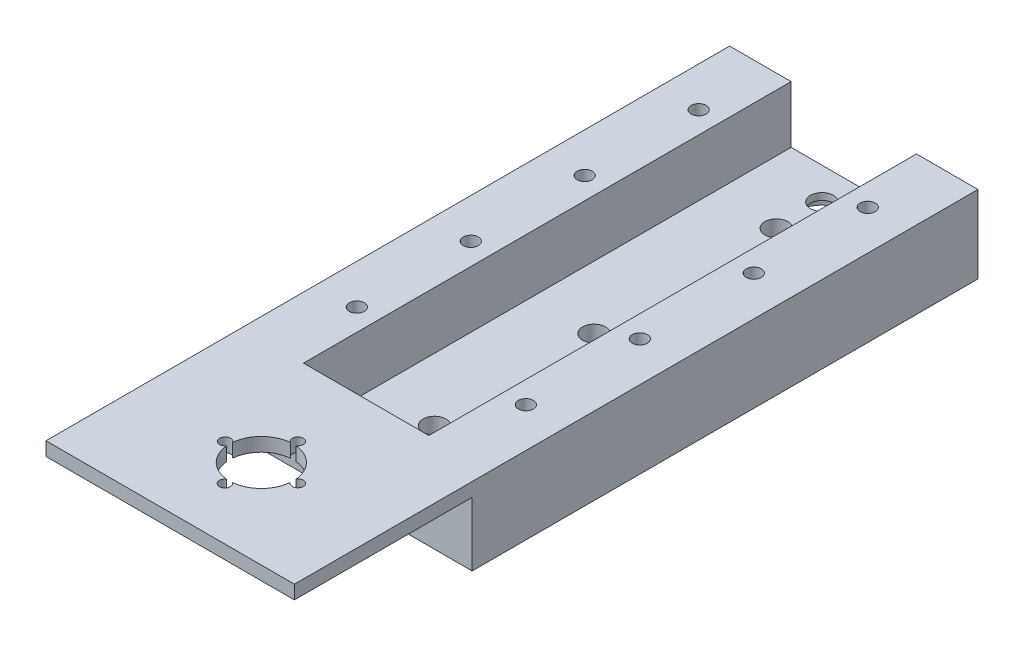
ISO-10303-21;
HEADER;
FILE_DESCRIPTION(('STEP AP214'),'2;1');
FILE_NAME('part.step','',(''),(''),'','','');
FILE_SCHEMA(('AUTOMOTIVE_DESIGN { 1 0 10303 214 1 1 1 1 }'));
ENDSEC;
DATA;
#1=APPLICATION_CONTEXT('core data for automotive mechanical design processes');
#2=APPLICATION_PROTOCOL_DEFINITION('international standard','automotive_design',2000,#1);
#3=PRODUCT_CONTEXT('',#1,'mechanical');
#4=PRODUCT('Part','Part','',(#3));
#5=PRODUCT_RELATED_PRODUCT_CATEGORY('part','',(#4));
#6=PRODUCT_DEFINITION_FORMATION('','',#4);
#7=PRODUCT_DEFINITION_CONTEXT('part definition',#1,'design');
#8=PRODUCT_DEFINITION('design','',#6,#7);
#9=PRODUCT_DEFINITION_SHAPE('','',#8);
#10=(LENGTH_UNIT() NAMED_UNIT(*) SI_UNIT(.MILLI.,.METRE.));
#11=(NAMED_UNIT(*) PLANE_ANGLE_UNIT() SI_UNIT($,.RADIAN.));
#12=(NAMED_UNIT(*) SI_UNIT($,.STERADIAN.) SOLID_ANGLE_UNIT());
#13=UNCERTAINTY_MEASURE_WITH_UNIT(LENGTH_MEASURE(1.E-05),#10,'distance_accuracy_value','');
#14=(GEOMETRIC_REPRESENTATION_CONTEXT(3) GLOBAL_UNCERTAINTY_ASSIGNED_CONTEXT((#13)) GLOBAL_UNIT_ASSIGNED_CONTEXT((#10,
#11,#12)) REPRESENTATION_CONTEXT('',''));
#15=CARTESIAN_POINT('',(0.,0.,0.));
#16=DIRECTION('',(0.,0.,1.));
#17=DIRECTION('',(1.,0.,0.));
#18=AXIS2_PLACEMENT_3D('',#15,#16,#17);
#19=CARTESIAN_POINT('',(-13.3995438408786,4.5,-92.6293125841432));
#20=DIRECTION('',(0.,1.,0.));
#21=DIRECTION('',(0.,0.,1.));
#22=AXIS2_PLACEMENT_3D('',#19,#20,#21);
#23=CYLINDRICAL_SURFACE('',#22,2.5273);
#24=CARTESIAN_POINT('',(-13.3995438408786,4.5,-92.6293125841432));
#25=DIRECTION('',(0.,1.,0.));
#26=DIRECTION('',(0.,0.,1.));
#27=AXIS2_PLACEMENT_3D('',#24,#25,#26);
#28=CIRCLE('',#27,2.5273);
#29=CARTESIAN_POINT('',(-13.3995438408786,4.5,-90.1020125841432));
#30=VERTEX_POINT('',#29);
#31=EDGE_CURVE('E167',#30,#30,#28,.T.);
#32=ORIENTED_EDGE('',*,*,#31,.T.);
#33=EDGE_LOOP('',(#32));
#34=FACE_BOUND('',#33,.T.);
#35=CARTESIAN_POINT('',(-13.3995438408786,3.,-92.6293125841432));
#36=DIRECTION('',(0.,-1.,0.));
#37=DIRECTION('',(0.,0.,-1.));
#38=AXIS2_PLACEMENT_3D('',#35,#36,#37);
#39=CIRCLE('',#38,2.5273);
#40=CARTESIAN_POINT('',(-13.3995438408786,3.,-95.1566125841432));
#41=VERTEX_POINT('',#40);
#42=EDGE_CURVE('E41',#41,#41,#39,.F.);
#43=ORIENTED_EDGE('',*,*,#42,.F.);
#44=EDGE_LOOP('',(#43));
#45=FACE_BOUND('',#44,.T.);
#46=ADVANCED_FACE('F37',(#34,#45),#23,.F.);
#47=CARTESIAN_POINT('',(-12.8995438408786,14.,30.8706874158568));
#48=DIRECTION('',(0.,1.,0.));
#49=DIRECTION('',(0.,0.,1.));
#50=AXIS2_PLACEMENT_3D('',#47,#48,#49);
#51=CYLINDRICAL_SURFACE('',#50,7.);
#52=CARTESIAN_POINT('',(-12.8995438408786,14.,30.8706874158568));
#53=DIRECTION('',(0.,1.,0.));
#54=DIRECTION('',(0.,0.,1.));
#55=AXIS2_PLACEMENT_3D('',#52,#53,#54);
#56=CIRCLE('',#55,7.);
#57=CARTESIAN_POINT('',(-19.8703289447228,14.,31.5095575403921));
#58=VERTEX_POINT('',#57);
#59=CARTESIAN_POINT('',(-13.5194178200066,14.,37.8431874158568));
#60=VERTEX_POINT('',#59);
#61=EDGE_CURVE('E175',#58,#60,#56,.T.);
#62=ORIENTED_EDGE('',*,*,#61,.F.);
#63=DIRECTION('',(0.,1.,0.));
#64=VECTOR('',#63,1.);
#65=CARTESIAN_POINT('',(-19.8703289447228,8.5,31.5095575403921));
#66=LINE('',#65,#64);
#67=CARTESIAN_POINT('',(-19.8703289447228,17.,31.5095575403921));
#68=VERTEX_POINT('',#67);
#69=EDGE_CURVE('E11',#58,#68,#66,.T.);
#70=ORIENTED_EDGE('',*,*,#69,.T.);
#71=CARTESIAN_POINT('',(-12.8995438408786,17.,30.8706874158568));
#72=DIRECTION('',(0.,1.,0.));
#73=DIRECTION('',(0.,0.,1.));
#74=AXIS2_PLACEMENT_3D('',#71,#72,#73);
#75=CIRCLE('',#74,7.);
#76=CARTESIAN_POINT('',(-13.5194178200066,17.,37.8431874158568));
#77=VERTEX_POINT('',#76);
#78=EDGE_CURVE('E173',#68,#77,#75,.T.);
#79=ORIENTED_EDGE('',*,*,#78,.T.);
#80=DIRECTION('',(0.,1.,0.));
#81=VECTOR('',#80,1.);
#82=CARTESIAN_POINT('',(-13.5194178200066,8.5,37.8431874158568));
#83=LINE('',#82,#81);
#84=EDGE_CURVE('E218',#77,#60,#83,.F.);
#85=ORIENTED_EDGE('',*,*,#84,.T.);
#86=EDGE_LOOP('',(#62,#70,#79,#85));
#87=FACE_BOUND('',#86,.T.);
#88=ADVANCED_FACE('F171',(#87),#51,.F.);
#89=CARTESIAN_POINT('',(0.,17.,0.));
#90=DIRECTION('',(0.,-1.,0.));
#91=DIRECTION('',(0.,0.,-1.));
#92=AXIS2_PLACEMENT_3D('',#89,#90,#91);
#93=PLANE('',#92);
#94=CARTESIAN_POINT('',(-31.9495438408786,17.,-9.1293125841432));
#95=DIRECTION('',(0.,1.,0.));
#96=DIRECTION('',(0.,0.,1.));
#97=AXIS2_PLACEMENT_3D('',#94,#95,#96);
#98=CIRCLE('',#97,1.65);
#99=CARTESIAN_POINT('',(-31.9495438408786,17.,-7.4793125841432));
#100=VERTEX_POINT('',#99);
#101=EDGE_CURVE('E320',#100,#100,#98,.T.);
#102=ORIENTED_EDGE('',*,*,#101,.F.);
#103=EDGE_LOOP('',(#102));
#104=FACE_BOUND('',#103,.T.);
#105=CARTESIAN_POINT('',(-31.9495438408786,17.,-34.1293125841432));
#106=DIRECTION('',(0.,1.,0.));
#107=DIRECTION('',(0.,0.,1.));
#108=AXIS2_PLACEMENT_3D('',#105,#106,#107);
#109=CIRCLE('',#108,1.65);
#110=CARTESIAN_POINT('',(-31.9495438408786,17.,-32.4793125841432));
#111=VERTEX_POINT('',#110);
#112=EDGE_CURVE('E314',#111,#111,#109,.T.);
#113=ORIENTED_EDGE('',*,*,#112,.F.);
#114=EDGE_LOOP('',(#113));
#115=FACE_BOUND('',#114,.T.);
#116=CARTESIAN_POINT('',(-31.9495438408786,17.,-59.1293125841432));
#117=DIRECTION('',(0.,1.,0.));
#118=DIRECTION('',(0.,0.,1.));
#119=AXIS2_PLACEMENT_3D('',#116,#117,#118);
#120=CIRCLE('',#119,1.65);
#121=CARTESIAN_POINT('',(-31.9495438408786,17.,-57.4793125841432));
#122=VERTEX_POINT('',#121);
#123=EDGE_CURVE('E308',#122,#122,#120,.T.);
#124=ORIENTED_EDGE('',*,*,#123,.F.);
#125=EDGE_LOOP('',(#124));
#126=FACE_BOUND('',#125,.T.);
#127=CARTESIAN_POINT('',(-31.9495438408786,17.,-84.1293125841432));
#128=DIRECTION('',(0.,1.,0.));
#129=DIRECTION('',(0.,0.,1.));
#130=AXIS2_PLACEMENT_3D('',#127,#128,#129);
#131=CIRCLE('',#130,1.65);
#132=CARTESIAN_POINT('',(-31.9495438408786,17.,-82.4793125841432));
#133=VERTEX_POINT('',#132);
#134=EDGE_CURVE('E302',#133,#133,#131,.T.);
#135=ORIENTED_EDGE('',*,*,#134,.F.);
#136=EDGE_LOOP('',(#135));
#137=FACE_BOUND('',#136,.T.);
#138=DIRECTION('',(0.,0.,1.));
#139=VECTOR('',#138,1.);
#140=CARTESIAN_POINT('',(-40.6495438408786,17.,-99.6293125841432));
#141=LINE('',#140,#139);
#142=CARTESIAN_POINT('',(-40.6495438408786,17.,-99.6293125841432));
#143=VERTEX_POINT('',#142);
#144=CARTESIAN_POINT('',(-40.6495438408786,17.,50.3706874158568));
#145=VERTEX_POINT('',#144);
#146=EDGE_CURVE('E250',#143,#145,#141,.T.);
#147=ORIENTED_EDGE('',*,*,#146,.T.);
#148=DIRECTION('',(-1.,0.,0.));
#149=VECTOR('',#148,1.);
#150=CARTESIAN_POINT('',(-40.6495438408786,17.,50.3706874158568));
#151=LINE('',#150,#149);
#152=CARTESIAN_POINT('',(13.8504561591214,17.,50.3706874158568));
#153=VERTEX_POINT('',#152);
#154=EDGE_CURVE('E338',#153,#145,#151,.T.);
#155=ORIENTED_EDGE('',*,*,#154,.F.);
#156=DIRECTION('',(0.,0.,1.));
#157=VECTOR('',#156,1.);
#158=CARTESIAN_POINT('',(13.8504561591214,17.,-99.6293125841432));
#159=LINE('',#158,#157);
#160=CARTESIAN_POINT('',(13.8504561591214,17.,-99.6293125841432));
#161=VERTEX_POINT('',#160);
#162=EDGE_CURVE('E262',#161,#153,#159,.T.);
#163=ORIENTED_EDGE('',*,*,#162,.F.);
#164=DIRECTION('',(1.,0.,0.));
#165=VECTOR('',#164,1.);
#166=CARTESIAN_POINT('',(0.350456159121413,17.,-99.6293125841432));
#167=LINE('',#166,#165);
#168=CARTESIAN_POINT('',(0.350456159121413,17.,-99.6293125841432));
#169=VERTEX_POINT('',#168);
#170=EDGE_CURVE('E264',#169,#161,#167,.T.);
#171=ORIENTED_EDGE('',*,*,#170,.F.);
#172=DIRECTION('',(0.,0.,1.));
#173=VECTOR('',#172,1.);
#174=CARTESIAN_POINT('',(0.350456159121413,17.,-99.6293125841432));
#175=LINE('',#174,#173);
#176=CARTESIAN_POINT('',(0.350456159121413,17.,7.37068741585679));
#177=VERTEX_POINT('',#176);
#178=EDGE_CURVE('E267',#169,#177,#175,.T.);
#179=ORIENTED_EDGE('',*,*,#178,.T.);
#180=DIRECTION('',(-1.,0.,0.));
#181=VECTOR('',#180,1.);
#182=CARTESIAN_POINT('',(9.85045615912145,17.,7.37068741585679));
#183=LINE('',#182,#181);
#184=CARTESIAN_POINT('',(-27.1495438408786,17.,7.3706874158568));
#185=VERTEX_POINT('',#184);
#186=EDGE_CURVE('E327',#177,#185,#183,.T.);
#187=ORIENTED_EDGE('',*,*,#186,.T.);
#188=DIRECTION('',(0.,0.,1.));
#189=VECTOR('',#188,1.);
#190=CARTESIAN_POINT('',(-27.1495438408786,17.,-99.6293125841432));
#191=LINE('',#190,#189);
#192=CARTESIAN_POINT('',(-27.1495438408786,17.,-99.6293125841432));
#193=VERTEX_POINT('',#192);
#194=EDGE_CURVE('E254',#193,#185,#191,.T.);
#195=ORIENTED_EDGE('',*,*,#194,.F.);
#196=DIRECTION('',(1.,0.,0.));
#197=VECTOR('',#196,1.);
#198=CARTESIAN_POINT('',(-40.6495438408786,17.,-99.6293125841432));
#199=LINE('',#198,#197);
#200=EDGE_CURVE('E257',#143,#193,#199,.T.);
#201=ORIENTED_EDGE('',*,*,#200,.F.);
#202=EDGE_LOOP('',(#147,#155,#163,#171,#179,#187,#195,#201));
#203=FACE_BOUND('',#202,.T.);
#204=CARTESIAN_POINT('',(5.15045615912143,17.,-84.1293125841432));
#205=DIRECTION('',(0.,1.,0.));
#206=DIRECTION('',(0.,0.,1.));
#207=AXIS2_PLACEMENT_3D('',#204,#205,#206);
#208=CIRCLE('',#207,1.65);
#209=CARTESIAN_POINT('',(5.15045615912143,17.,-82.4793125841432));
#210=VERTEX_POINT('',#209);
#211=EDGE_CURVE('E278',#210,#210,#208,.T.);
#212=ORIENTED_EDGE('',*,*,#211,.F.);
#213=EDGE_LOOP('',(#212));
#214=FACE_BOUND('',#213,.T.);
#215=CARTESIAN_POINT('',(5.15045615912143,17.,-59.1293125841432));
#216=DIRECTION('',(0.,1.,0.));
#217=DIRECTION('',(0.,0.,1.));
#218=AXIS2_PLACEMENT_3D('',#215,#216,#217);
#219=CIRCLE('',#218,1.65);
#220=CARTESIAN_POINT('',(5.15045615912143,17.,-57.4793125841432));
#221=VERTEX_POINT('',#220);
#222=EDGE_CURVE('E284',#221,#221,#219,.T.);
#223=ORIENTED_EDGE('',*,*,#222,.F.);
#224=EDGE_LOOP('',(#223));
#225=FACE_BOUND('',#224,.T.);
#226=CARTESIAN_POINT('',(5.15045615912143,17.,-34.1293125841432));
#227=DIRECTION('',(0.,1.,0.));
#228=DIRECTION('',(0.,0.,1.));
#229=AXIS2_PLACEMENT_3D('',#226,#227,#228);
#230=CIRCLE('',#229,1.65);
#231=CARTESIAN_POINT('',(5.15045615912143,17.,-32.4793125841432));
#232=VERTEX_POINT('',#231);
#233=EDGE_CURVE('E290',#232,#232,#230,.T.);
#234=ORIENTED_EDGE('',*,*,#233,.F.);
#235=EDGE_LOOP('',(#234));
#236=FACE_BOUND('',#235,.T.);
#237=CARTESIAN_POINT('',(5.15045615912143,17.,-9.1293125841432));
#238=DIRECTION('',(0.,1.,0.));
#239=DIRECTION('',(0.,0.,1.));
#240=AXIS2_PLACEMENT_3D('',#237,#238,#239);
#241=CIRCLE('',#240,1.65);
#242=CARTESIAN_POINT('',(5.15045615912143,17.,-7.4793125841432));
#243=VERTEX_POINT('',#242);
#244=EDGE_CURVE('E296',#243,#243,#241,.T.);
#245=ORIENTED_EDGE('',*,*,#244,.F.);
#246=EDGE_LOOP('',(#245));
#247=FACE_BOUND('',#246,.T.);
#248=ORIENTED_EDGE('',*,*,#78,.F.);
#249=CARTESIAN_POINT('',(-20.8714371180351,17.,30.8479062535898));
#250=DIRECTION('',(0.,1.,0.));
#251=DIRECTION('',(0.,0.,1.));
#252=AXIS2_PLACEMENT_3D('',#249,#250,#251);
#253=CIRCLE('',#252,1.2);
#254=CARTESIAN_POINT('',(-19.8665637439829,17.,30.1919874307765));
#255=VERTEX_POINT('',#254);
#256=EDGE_CURVE('E161',#255,#68,#253,.T.);
#257=ORIENTED_EDGE('',*,*,#256,.F.);
#258=CARTESIAN_POINT('',(-13.5194178200066,17.,23.8981874158568));
#259=VERTEX_POINT('',#258);
#260=EDGE_CURVE('E180',#259,#255,#75,.T.);
#261=ORIENTED_EDGE('',*,*,#260,.F.);
#262=CARTESIAN_POINT('',(-12.8995438408786,17.,22.8706874158568));
#263=DIRECTION('',(0.,1.,0.));
#264=DIRECTION('',(0.,0.,1.));
#265=AXIS2_PLACEMENT_3D('',#262,#263,#264);
#266=CIRCLE('',#265,1.2);
#267=CARTESIAN_POINT('',(-12.2796698617505,17.,23.8981874158568));
#268=VERTEX_POINT('',#267);
#269=EDGE_CURVE('E500',#268,#259,#266,.T.);
#270=ORIENTED_EDGE('',*,*,#269,.F.);
#271=CARTESIAN_POINT('',(-5.93313001042028,17.,30.1857944732743));
#272=VERTEX_POINT('',#271);
#273=EDGE_CURVE('E183',#272,#268,#75,.T.);
#274=ORIENTED_EDGE('',*,*,#273,.F.);
#275=CARTESIAN_POINT('',(-4.93047554219228,17.,30.8451001818363));
#276=DIRECTION('',(0.,1.,0.));
#277=DIRECTION('',(0.,0.,1.));
#278=AXIS2_PLACEMENT_3D('',#275,#276,#277);
#279=CIRCLE('',#278,1.2);
#280=CARTESIAN_POINT('',(-5.92887555855517,17.,31.510830913684));
#281=VERTEX_POINT('',#280);
#282=EDGE_CURVE('E492',#281,#272,#279,.T.);
#283=ORIENTED_EDGE('',*,*,#282,.F.);
#284=CARTESIAN_POINT('',(-12.2796698617506,17.,37.8431874158568));
#285=VERTEX_POINT('',#284);
#286=EDGE_CURVE('E181',#285,#281,#75,.T.);
#287=ORIENTED_EDGE('',*,*,#286,.F.);
#288=CARTESIAN_POINT('',(-12.8995438408786,17.,38.8706874158568));
#289=DIRECTION('',(0.,1.,0.));
#290=DIRECTION('',(0.,0.,1.));
#291=AXIS2_PLACEMENT_3D('',#288,#289,#290);
#292=CIRCLE('',#291,1.2);
#293=EDGE_CURVE('E179',#77,#285,#292,.T.);
#294=ORIENTED_EDGE('',*,*,#293,.F.);
#295=EDGE_LOOP('',(#248,#257,#261,#270,#274,#283,#287,#294));
#296=FACE_BOUND('',#295,.T.);
#297=ADVANCED_FACE('F177',(#104,#115,#126,#137,#203,#214,#225,#236,#247,#296),#93,.F.);
#298=ORIENTED_EDGE('',*,*,#260,.T.);
#299=DIRECTION('',(0.,1.,0.));
#300=VECTOR('',#299,1.);
#301=CARTESIAN_POINT('',(-19.8665637439829,8.5,30.1919874307765));
#302=LINE('',#301,#300);
#303=CARTESIAN_POINT('',(-19.8665637439829,14.,30.1919874307765));
#304=VERTEX_POINT('',#303);
#305=EDGE_CURVE('E46',#255,#304,#302,.F.);
#306=ORIENTED_EDGE('',*,*,#305,.T.);
#307=CARTESIAN_POINT('',(-13.5194178200066,14.,23.8981874158568));
#308=VERTEX_POINT('',#307);
#309=EDGE_CURVE('E193',#308,#304,#56,.T.);
#310=ORIENTED_EDGE('',*,*,#309,.F.);
#311=DIRECTION('',(0.,1.,0.));
#312=VECTOR('',#311,1.);
#313=CARTESIAN_POINT('',(-13.5194178200066,8.5,23.8981874158568));
#314=LINE('',#313,#312);
#315=EDGE_CURVE('E209',#308,#259,#314,.T.);
#316=ORIENTED_EDGE('',*,*,#315,.T.);
#317=EDGE_LOOP('',(#298,#306,#310,#316));
#318=FACE_BOUND('',#317,.T.);
#319=ADVANCED_FACE('F208',(#318),#51,.F.);
#320=CARTESIAN_POINT('',(-12.2796698617506,14.,37.8431874158568));
#321=VERTEX_POINT('',#320);
#322=CARTESIAN_POINT('',(-5.92887555855517,14.,31.510830913684));
#323=VERTEX_POINT('',#322);
#324=EDGE_CURVE('E188',#321,#323,#56,.T.);
#325=ORIENTED_EDGE('',*,*,#324,.F.);
#326=DIRECTION('',(0.,1.,0.));
#327=VECTOR('',#326,1.);
#328=CARTESIAN_POINT('',(-12.2796698617506,8.5,37.8431874158568));
#329=LINE('',#328,#327);
#330=EDGE_CURVE('E215',#321,#285,#329,.T.);
#331=ORIENTED_EDGE('',*,*,#330,.T.);
#332=ORIENTED_EDGE('',*,*,#286,.T.);
#333=DIRECTION('',(0.,1.,0.));
#334=VECTOR('',#333,1.);
#335=CARTESIAN_POINT('',(-5.92887555855517,8.5,31.510830913684));
#336=LINE('',#335,#334);
#337=EDGE_CURVE('E222',#281,#323,#336,.F.);
#338=ORIENTED_EDGE('',*,*,#337,.T.);
#339=EDGE_LOOP('',(#325,#331,#332,#338));
#340=FACE_BOUND('',#339,.T.);
#341=ADVANCED_FACE('F429',(#340),#51,.F.);
#342=CARTESIAN_POINT('',(-40.6495438408786,4.5,11.3706874158568));
#343=DIRECTION('',(0.,0.,-1.));
#344=DIRECTION('',(-1.,0.,0.));
#345=AXIS2_PLACEMENT_3D('',#342,#343,#344);
#346=PLANE('',#345);
#347=DIRECTION('',(1.,0.,0.));
#348=VECTOR('',#347,1.);
#349=CARTESIAN_POINT('',(-40.6495438408786,14.,11.3706874158568));
#350=LINE('',#349,#348);
#351=CARTESIAN_POINT('',(-40.6495438408786,14.,11.3706874158568));
#352=VERTEX_POINT('',#351);
#353=CARTESIAN_POINT('',(13.8504561591214,14.,11.3706874158568));
#354=VERTEX_POINT('',#353);
#355=EDGE_CURVE('E201',#352,#354,#350,.T.);
#356=ORIENTED_EDGE('',*,*,#355,.F.);
#357=DIRECTION('',(0.,-1.,0.));
#358=VECTOR('',#357,1.);
#359=CARTESIAN_POINT('',(-40.6495438408786,4.5,11.3706874158568));
#360=LINE('',#359,#358);
#361=CARTESIAN_POINT('',(-40.6495438408786,0.,11.3706874158568));
#362=VERTEX_POINT('',#361);
#363=EDGE_CURVE('E225',#352,#362,#360,.T.);
#364=ORIENTED_EDGE('',*,*,#363,.T.);
#365=DIRECTION('',(1.,0.,0.));
#366=VECTOR('',#365,1.);
#367=CARTESIAN_POINT('',(-40.6495438408786,0.,11.3706874158568));
#368=LINE('',#367,#366);
#369=CARTESIAN_POINT('',(13.8504561591214,0.,11.3706874158568));
#370=VERTEX_POINT('',#369);
#371=EDGE_CURVE('E240',#362,#370,#368,.T.);
#372=ORIENTED_EDGE('',*,*,#371,.T.);
#373=DIRECTION('',(0.,-1.,0.));
#374=VECTOR('',#373,1.);
#375=CARTESIAN_POINT('',(13.8504561591214,4.5,11.3706874158568));
#376=LINE('',#375,#374);
#377=EDGE_CURVE('E227',#354,#370,#376,.T.);
#378=ORIENTED_EDGE('',*,*,#377,.F.);
#379=EDGE_LOOP('',(#356,#364,#372,#378));
#380=FACE_BOUND('',#379,.T.);
#381=ADVANCED_FACE('F375',(#380),#346,.F.);
#382=CARTESIAN_POINT('',(0.,4.5,0.));
#383=DIRECTION('',(0.,-1.,0.));
#384=DIRECTION('',(0.,0.,-1.));
#385=AXIS2_PLACEMENT_3D('',#382,#383,#384);
#386=PLANE('',#385);
#387=CARTESIAN_POINT('',(-13.3995438408786,4.5,2.37068741585679));
#388=DIRECTION('',(0.,1.,0.));
#389=DIRECTION('',(0.,0.,1.));
#390=AXIS2_PLACEMENT_3D('',#387,#388,#389);
#391=CIRCLE('',#390,2.5273);
#392=CARTESIAN_POINT('',(-13.3995438408786,4.5,4.89798741585679));
#393=VERTEX_POINT('',#392);
#394=EDGE_CURVE('E525',#393,#393,#391,.T.);
#395=ORIENTED_EDGE('',*,*,#394,.F.);
#396=EDGE_LOOP('',(#395));
#397=FACE_BOUND('',#396,.T.);
#398=CARTESIAN_POINT('',(-13.3995438408786,4.5,-7.62931258414321));
#399=DIRECTION('',(0.,1.,0.));
#400=DIRECTION('',(0.,0.,1.));
#401=AXIS2_PLACEMENT_3D('',#398,#399,#400);
#402=CIRCLE('',#401,2.5273);
#403=CARTESIAN_POINT('',(-13.3995438408786,4.5,-5.10201258414321));
#404=VERTEX_POINT('',#403);
#405=EDGE_CURVE('E519',#404,#404,#402,.T.);
#406=ORIENTED_EDGE('',*,*,#405,.F.);
#407=EDGE_LOOP('',(#406));
#408=FACE_BOUND('',#407,.T.);
#409=CARTESIAN_POINT('',(-13.3995438408786,4.5,-42.6293125841432));
#410=DIRECTION('',(0.,1.,0.));
#411=DIRECTION('',(0.,0.,1.));
#412=AXIS2_PLACEMENT_3D('',#409,#410,#411);
#413=CIRCLE('',#412,2.5273);
#414=CARTESIAN_POINT('',(-13.3995438408786,4.5,-40.1020125841432));
#415=VERTEX_POINT('',#414);
#416=EDGE_CURVE('E513',#415,#415,#413,.T.);
#417=ORIENTED_EDGE('',*,*,#416,.F.);
#418=EDGE_LOOP('',(#417));
#419=FACE_BOUND('',#418,.T.);
#420=CARTESIAN_POINT('',(-13.3995438408786,4.5,-82.6293125841432));
#421=DIRECTION('',(0.,1.,0.));
#422=DIRECTION('',(0.,0.,1.));
#423=AXIS2_PLACEMENT_3D('',#420,#421,#422);
#424=CIRCLE('',#423,2.5273);
#425=CARTESIAN_POINT('',(-13.3995438408786,4.5,-80.1020125841432));
#426=VERTEX_POINT('',#425);
#427=EDGE_CURVE('E507',#426,#426,#424,.T.);
#428=ORIENTED_EDGE('',*,*,#427,.F.);
#429=EDGE_LOOP('',(#428));
#430=FACE_BOUND('',#429,.T.);
#431=ORIENTED_EDGE('',*,*,#31,.F.);
#432=EDGE_LOOP('',(#431));
#433=FACE_BOUND('',#432,.T.);
#434=DIRECTION('',(-1.,0.,0.));
#435=VECTOR('',#434,1.);
#436=CARTESIAN_POINT('',(9.85045615912145,4.5,7.37068741585679));
#437=LINE('',#436,#435);
#438=CARTESIAN_POINT('',(0.350456159121427,4.5,7.37068741585679));
#439=VERTEX_POINT('',#438);
#440=CARTESIAN_POINT('',(-27.1495438408786,4.5,7.3706874158568));
#441=VERTEX_POINT('',#440);
#442=EDGE_CURVE('E325',#439,#441,#437,.T.);
#443=ORIENTED_EDGE('',*,*,#442,.F.);
#444=DIRECTION('',(0.,0.,1.));
#445=VECTOR('',#444,1.);
#446=CARTESIAN_POINT('',(0.350456159121413,4.5,-99.6293125841432));
#447=LINE('',#446,#445);
#448=CARTESIAN_POINT('',(0.350456159121423,4.5,-99.6293125841432));
#449=VERTEX_POINT('',#448);
#450=EDGE_CURVE('E255',#449,#439,#447,.T.);
#451=ORIENTED_EDGE('',*,*,#450,.F.);
#452=DIRECTION('',(-1.,0.,0.));
#453=VECTOR('',#452,1.);
#454=CARTESIAN_POINT('',(-40.6495438408786,4.5,-99.6293125841432));
#455=LINE('',#454,#453);
#456=CARTESIAN_POINT('',(-27.1495438408786,4.5,-99.6293125841432));
#457=VERTEX_POINT('',#456);
#458=EDGE_CURVE('E235',#449,#457,#455,.T.);
#459=ORIENTED_EDGE('',*,*,#458,.T.);
#460=DIRECTION('',(0.,0.,1.));
#461=VECTOR('',#460,1.);
#462=CARTESIAN_POINT('',(-27.1495438408786,4.5,-99.6293125841432));
#463=LINE('',#462,#461);
#464=EDGE_CURVE('E251',#457,#441,#463,.T.);
#465=ORIENTED_EDGE('',*,*,#464,.T.);
#466=EDGE_LOOP('',(#443,#451,#459,#465));
#467=FACE_BOUND('',#466,.T.);
#468=ADVANCED_FACE('F387',(#397,#408,#419,#430,#433,#467),#386,.F.);
#469=CARTESIAN_POINT('',(-27.1495438408786,17.,-99.6293125841432));
#470=DIRECTION('',(1.,0.,0.));
#471=DIRECTION('',(0.,0.,-1.));
#472=AXIS2_PLACEMENT_3D('',#469,#470,#471);
#473=PLANE('',#472);
#474=ORIENTED_EDGE('',*,*,#194,.T.);
#475=DIRECTION('',(0.,1.,0.));
#476=VECTOR('',#475,1.);
#477=CARTESIAN_POINT('',(-27.1495438408786,17.,7.3706874158568));
#478=LINE('',#477,#476);
#479=EDGE_CURVE('E329',#441,#185,#478,.T.);
#480=ORIENTED_EDGE('',*,*,#479,.F.);
#481=ORIENTED_EDGE('',*,*,#464,.F.);
#482=DIRECTION('',(0.,-1.,0.));
#483=VECTOR('',#482,1.);
#484=CARTESIAN_POINT('',(-27.1495438408786,17.,-99.6293125841432));
#485=LINE('',#484,#483);
#486=EDGE_CURVE('E246',#193,#457,#485,.T.);
#487=ORIENTED_EDGE('',*,*,#486,.F.);
#488=EDGE_LOOP('',(#474,#480,#481,#487));
#489=FACE_BOUND('',#488,.T.);
#490=ADVANCED_FACE('F390',(#489),#473,.T.);
#491=CARTESIAN_POINT('',(0.350456159121413,17.,-99.6293125841432));
#492=DIRECTION('',(1.,0.,0.));
#493=DIRECTION('',(0.,0.,-1.));
#494=AXIS2_PLACEMENT_3D('',#491,#492,#493);
#495=PLANE('',#494);
#496=DIRECTION('',(0.,-1.,0.));
#497=VECTOR('',#496,1.);
#498=CARTESIAN_POINT('',(0.350456159121426,17.,7.37068741585679));
#499=LINE('',#498,#497);
#500=EDGE_CURVE('E323',#177,#439,#499,.T.);
#501=ORIENTED_EDGE('',*,*,#500,.F.);
#502=ORIENTED_EDGE('',*,*,#178,.F.);
#503=DIRECTION('',(0.,-1.,0.));
#504=VECTOR('',#503,1.);
#505=CARTESIAN_POINT('',(0.350456159121413,17.,-99.6293125841432));
#506=LINE('',#505,#504);
#507=EDGE_CURVE('E270',#169,#449,#506,.T.);
#508=ORIENTED_EDGE('',*,*,#507,.T.);
#509=ORIENTED_EDGE('',*,*,#450,.T.);
#510=EDGE_LOOP('',(#501,#502,#508,#509));
#511=FACE_BOUND('',#510,.T.);
#512=ADVANCED_FACE('F381',(#511),#495,.F.);
#513=CARTESIAN_POINT('',(-40.6495438408786,4.5,11.3706874158568));
#514=DIRECTION('',(1.,0.,0.));
#515=DIRECTION('',(0.,0.,-1.));
#516=AXIS2_PLACEMENT_3D('',#513,#514,#515);
#517=PLANE('',#516);
#518=DIRECTION('',(0.,0.,1.));
#519=VECTOR('',#518,1.);
#520=CARTESIAN_POINT('',(-40.6495438408786,0.,11.3706874158568));
#521=LINE('',#520,#519);
#522=CARTESIAN_POINT('',(-40.6495438408786,0.,-99.6293125841432));
#523=VERTEX_POINT('',#522);
#524=EDGE_CURVE('E243',#523,#362,#521,.T.);
#525=ORIENTED_EDGE('',*,*,#524,.T.);
#526=ORIENTED_EDGE('',*,*,#363,.F.);
#527=DIRECTION('',(0.,0.,-1.));
#528=VECTOR('',#527,1.);
#529=CARTESIAN_POINT('',(-40.6495438408786,14.,50.3706874158568));
#530=LINE('',#529,#528);
#531=CARTESIAN_POINT('',(-40.6495438408786,14.,50.3706874158568));
#532=VERTEX_POINT('',#531);
#533=EDGE_CURVE('E332',#532,#352,#530,.T.);
#534=ORIENTED_EDGE('',*,*,#533,.F.);
#535=DIRECTION('',(0.,-1.,0.));
#536=VECTOR('',#535,1.);
#537=CARTESIAN_POINT('',(-40.6495438408786,17.,50.3706874158568));
#538=LINE('',#537,#536);
#539=EDGE_CURVE('E341',#145,#532,#538,.T.);
#540=ORIENTED_EDGE('',*,*,#539,.F.);
#541=ORIENTED_EDGE('',*,*,#146,.F.);
#542=DIRECTION('',(0.,-1.,0.));
#543=VECTOR('',#542,1.);
#544=CARTESIAN_POINT('',(-40.6495438408786,4.5,-99.6293125841432));
#545=LINE('',#544,#543);
#546=EDGE_CURVE('E232',#143,#523,#545,.T.);
#547=ORIENTED_EDGE('',*,*,#546,.T.);
#548=EDGE_LOOP('',(#525,#526,#534,#540,#541,#547));
#549=FACE_BOUND('',#548,.T.);
#550=ADVANCED_FACE('F39',(#549),#517,.F.);
#551=CARTESIAN_POINT('',(13.8504561591214,4.5,11.3706874158568));
#552=DIRECTION('',(-1.,0.,0.));
#553=DIRECTION('',(0.,0.,1.));
#554=AXIS2_PLACEMENT_3D('',#551,#552,#553);
#555=PLANE('',#554);
#556=DIRECTION('',(0.,0.,-1.));
#557=VECTOR('',#556,1.);
#558=CARTESIAN_POINT('',(13.8504561591214,0.,11.3706874158568));
#559=LINE('',#558,#557);
#560=CARTESIAN_POINT('',(13.8504561591214,0.,-99.6293125841432));
#561=VERTEX_POINT('',#560);
#562=EDGE_CURVE('E238',#370,#561,#559,.T.);
#563=ORIENTED_EDGE('',*,*,#562,.T.);
#564=DIRECTION('',(0.,-1.,0.));
#565=VECTOR('',#564,1.);
#566=CARTESIAN_POINT('',(13.8504561591214,4.5,-99.6293125841432));
#567=LINE('',#566,#565);
#568=EDGE_CURVE('E229',#161,#561,#567,.T.);
#569=ORIENTED_EDGE('',*,*,#568,.F.);
#570=ORIENTED_EDGE('',*,*,#162,.T.);
#571=DIRECTION('',(0.,1.,0.));
#572=VECTOR('',#571,1.);
#573=CARTESIAN_POINT('',(13.8504561591214,17.,50.3706874158568));
#574=LINE('',#573,#572);
#575=CARTESIAN_POINT('',(13.8504561591214,14.,50.3706874158568));
#576=VERTEX_POINT('',#575);
#577=EDGE_CURVE('E344',#576,#153,#574,.T.);
#578=ORIENTED_EDGE('',*,*,#577,.F.);
#579=DIRECTION('',(0.,0.,-1.));
#580=VECTOR('',#579,1.);
#581=CARTESIAN_POINT('',(13.8504561591214,14.,50.3706874158568));
#582=LINE('',#581,#580);
#583=EDGE_CURVE('E335',#576,#354,#582,.T.);
#584=ORIENTED_EDGE('',*,*,#583,.T.);
#585=ORIENTED_EDGE('',*,*,#377,.T.);
#586=EDGE_LOOP('',(#563,#569,#570,#578,#584,#585));
#587=FACE_BOUND('',#586,.T.);
#588=ADVANCED_FACE('F360',(#587),#555,.F.);
#589=CARTESIAN_POINT('',(-40.6495438408786,4.5,-99.6293125841432));
#590=DIRECTION('',(0.,0.,1.));
#591=DIRECTION('',(1.,0.,0.));
#592=AXIS2_PLACEMENT_3D('',#589,#590,#591);
#593=PLANE('',#592);
#594=DIRECTION('',(-1.,0.,0.));
#595=VECTOR('',#594,1.);
#596=CARTESIAN_POINT('',(-40.6495438408786,0.,-99.6293125841432));
#597=LINE('',#596,#595);
#598=EDGE_CURVE('E236',#561,#523,#597,.T.);
#599=ORIENTED_EDGE('',*,*,#598,.T.);
#600=ORIENTED_EDGE('',*,*,#546,.F.);
#601=ORIENTED_EDGE('',*,*,#200,.T.);
#602=ORIENTED_EDGE('',*,*,#486,.T.);
#603=ORIENTED_EDGE('',*,*,#458,.F.);
#604=ORIENTED_EDGE('',*,*,#507,.F.);
#605=ORIENTED_EDGE('',*,*,#170,.T.);
#606=ORIENTED_EDGE('',*,*,#568,.T.);
#607=EDGE_LOOP('',(#599,#600,#601,#602,#603,#604,#605,#606));
#608=FACE_BOUND('',#607,.T.);
#609=ADVANCED_FACE('F376',(#608),#593,.F.);
#610=CARTESIAN_POINT('',(0.,0.,0.));
#611=DIRECTION('',(0.,-1.,0.));
#612=DIRECTION('',(0.,0.,-1.));
#613=AXIS2_PLACEMENT_3D('',#610,#611,#612);
#614=PLANE('',#613);
#615=CARTESIAN_POINT('',(-13.3995438408786,0.,-92.6293125841432));
#616=DIRECTION('',(0.,-1.,0.));
#617=DIRECTION('',(0.,0.,-1.));
#618=AXIS2_PLACEMENT_3D('',#615,#616,#617);
#619=CIRCLE('',#618,5.5);
#620=CARTESIAN_POINT('',(-13.3995438408786,0.,-98.1293125841432));
#621=VERTEX_POINT('',#620);
#622=EDGE_CURVE('E528',#621,#621,#619,.T.);
#623=ORIENTED_EDGE('',*,*,#622,.F.);
#624=EDGE_LOOP('',(#623));
#625=FACE_BOUND('',#624,.T.);
#626=CARTESIAN_POINT('',(-13.3995438408786,0.,2.37068741585679));
#627=DIRECTION('',(0.,1.,0.));
#628=DIRECTION('',(0.,0.,1.));
#629=AXIS2_PLACEMENT_3D('',#626,#627,#628);
#630=CIRCLE('',#629,2.5273);
#631=CARTESIAN_POINT('',(-13.3995438408786,0.,4.89798741585679));
#632=VERTEX_POINT('',#631);
#633=EDGE_CURVE('E522',#632,#632,#630,.T.);
#634=ORIENTED_EDGE('',*,*,#633,.T.);
#635=EDGE_LOOP('',(#634));
#636=FACE_BOUND('',#635,.T.);
#637=CARTESIAN_POINT('',(-13.3995438408786,0.,-7.62931258414321));
#638=DIRECTION('',(0.,1.,0.));
#639=DIRECTION('',(0.,0.,1.));
#640=AXIS2_PLACEMENT_3D('',#637,#638,#639);
#641=CIRCLE('',#640,2.5273);
#642=CARTESIAN_POINT('',(-13.3995438408786,0.,-5.10201258414321));
#643=VERTEX_POINT('',#642);
#644=EDGE_CURVE('E516',#643,#643,#641,.T.);
#645=ORIENTED_EDGE('',*,*,#644,.T.);
#646=EDGE_LOOP('',(#645));
#647=FACE_BOUND('',#646,.T.);
#648=CARTESIAN_POINT('',(-13.3995438408786,0.,-42.6293125841432));
#649=DIRECTION('',(0.,1.,0.));
#650=DIRECTION('',(0.,0.,1.));
#651=AXIS2_PLACEMENT_3D('',#648,#649,#650);
#652=CIRCLE('',#651,2.5273);
#653=CARTESIAN_POINT('',(-13.3995438408786,0.,-40.1020125841432));
#654=VERTEX_POINT('',#653);
#655=EDGE_CURVE('E510',#654,#654,#652,.T.);
#656=ORIENTED_EDGE('',*,*,#655,.T.);
#657=EDGE_LOOP('',(#656));
#658=FACE_BOUND('',#657,.T.);
#659=CARTESIAN_POINT('',(-13.3995438408786,0.,-82.6293125841432));
#660=DIRECTION('',(0.,1.,0.));
#661=DIRECTION('',(0.,0.,1.));
#662=AXIS2_PLACEMENT_3D('',#659,#660,#661);
#663=CIRCLE('',#662,2.5273);
#664=CARTESIAN_POINT('',(-13.3995438408786,0.,-80.1020125841432));
#665=VERTEX_POINT('',#664);
#666=EDGE_CURVE('E504',#665,#665,#663,.T.);
#667=ORIENTED_EDGE('',*,*,#666,.T.);
#668=EDGE_LOOP('',(#667));
#669=FACE_BOUND('',#668,.T.);
#670=CARTESIAN_POINT('',(-31.9495438408786,0.,-9.1293125841432));
#671=DIRECTION('',(0.,1.,0.));
#672=DIRECTION('',(0.,0.,1.));
#673=AXIS2_PLACEMENT_3D('',#670,#671,#672);
#674=CIRCLE('',#673,1.65);
#675=CARTESIAN_POINT('',(-31.9495438408786,0.,-7.4793125841432));
#676=VERTEX_POINT('',#675);
#677=EDGE_CURVE('E317',#676,#676,#674,.T.);
#678=ORIENTED_EDGE('',*,*,#677,.T.);
#679=EDGE_LOOP('',(#678));
#680=FACE_BOUND('',#679,.T.);
#681=CARTESIAN_POINT('',(-31.9495438408786,0.,-34.1293125841432));
#682=DIRECTION('',(0.,1.,0.));
#683=DIRECTION('',(0.,0.,1.));
#684=AXIS2_PLACEMENT_3D('',#681,#682,#683);
#685=CIRCLE('',#684,1.65);
#686=CARTESIAN_POINT('',(-31.9495438408786,0.,-32.4793125841432));
#687=VERTEX_POINT('',#686);
#688=EDGE_CURVE('E311',#687,#687,#685,.T.);
#689=ORIENTED_EDGE('',*,*,#688,.T.);
#690=EDGE_LOOP('',(#689));
#691=FACE_BOUND('',#690,.T.);
#692=CARTESIAN_POINT('',(-31.9495438408786,0.,-59.1293125841432));
#693=DIRECTION('',(0.,1.,0.));
#694=DIRECTION('',(0.,0.,1.));
#695=AXIS2_PLACEMENT_3D('',#692,#693,#694);
#696=CIRCLE('',#695,1.65);
#697=CARTESIAN_POINT('',(-31.9495438408786,0.,-57.4793125841432));
#698=VERTEX_POINT('',#697);
#699=EDGE_CURVE('E305',#698,#698,#696,.T.);
#700=ORIENTED_EDGE('',*,*,#699,.T.);
#701=EDGE_LOOP('',(#700));
#702=FACE_BOUND('',#701,.T.);
#703=CARTESIAN_POINT('',(-31.9495438408786,0.,-84.1293125841432));
#704=DIRECTION('',(0.,1.,0.));
#705=DIRECTION('',(0.,0.,1.));
#706=AXIS2_PLACEMENT_3D('',#703,#704,#705);
#707=CIRCLE('',#706,1.65);
#708=CARTESIAN_POINT('',(-31.9495438408786,0.,-82.4793125841432));
#709=VERTEX_POINT('',#708);
#710=EDGE_CURVE('E299',#709,#709,#707,.T.);
#711=ORIENTED_EDGE('',*,*,#710,.T.);
#712=EDGE_LOOP('',(#711));
#713=FACE_BOUND('',#712,.T.);
#714=CARTESIAN_POINT('',(5.15045615912143,0.,-9.1293125841432));
#715=DIRECTION('',(0.,1.,0.));
#716=DIRECTION('',(0.,0.,1.));
#717=AXIS2_PLACEMENT_3D('',#714,#715,#716);
#718=CIRCLE('',#717,1.65);
#719=CARTESIAN_POINT('',(5.15045615912143,0.,-7.4793125841432));
#720=VERTEX_POINT('',#719);
#721=EDGE_CURVE('E293',#720,#720,#718,.T.);
#722=ORIENTED_EDGE('',*,*,#721,.T.);
#723=EDGE_LOOP('',(#722));
#724=FACE_BOUND('',#723,.T.);
#725=CARTESIAN_POINT('',(5.15045615912143,0.,-34.1293125841432));
#726=DIRECTION('',(0.,1.,0.));
#727=DIRECTION('',(0.,0.,1.));
#728=AXIS2_PLACEMENT_3D('',#725,#726,#727);
#729=CIRCLE('',#728,1.65);
#730=CARTESIAN_POINT('',(5.15045615912143,0.,-32.4793125841432));
#731=VERTEX_POINT('',#730);
#732=EDGE_CURVE('E287',#731,#731,#729,.T.);
#733=ORIENTED_EDGE('',*,*,#732,.T.);
#734=EDGE_LOOP('',(#733));
#735=FACE_BOUND('',#734,.T.);
#736=CARTESIAN_POINT('',(5.15045615912143,0.,-59.1293125841432));
#737=DIRECTION('',(0.,1.,0.));
#738=DIRECTION('',(0.,0.,1.));
#739=AXIS2_PLACEMENT_3D('',#736,#737,#738);
#740=CIRCLE('',#739,1.65);
#741=CARTESIAN_POINT('',(5.15045615912143,0.,-57.4793125841432));
#742=VERTEX_POINT('',#741);
#743=EDGE_CURVE('E281',#742,#742,#740,.T.);
#744=ORIENTED_EDGE('',*,*,#743,.T.);
#745=EDGE_LOOP('',(#744));
#746=FACE_BOUND('',#745,.T.);
#747=CARTESIAN_POINT('',(5.15045615912143,0.,-84.1293125841432));
#748=DIRECTION('',(0.,1.,0.));
#749=DIRECTION('',(0.,0.,1.));
#750=AXIS2_PLACEMENT_3D('',#747,#748,#749);
#751=CIRCLE('',#750,1.65);
#752=CARTESIAN_POINT('',(5.15045615912143,0.,-82.4793125841432));
#753=VERTEX_POINT('',#752);
#754=EDGE_CURVE('E275',#753,#753,#751,.T.);
#755=ORIENTED_EDGE('',*,*,#754,.T.);
#756=EDGE_LOOP('',(#755));
#757=FACE_BOUND('',#756,.T.);
#758=ORIENTED_EDGE('',*,*,#524,.F.);
#759=ORIENTED_EDGE('',*,*,#598,.F.);
#760=ORIENTED_EDGE('',*,*,#562,.F.);
#761=ORIENTED_EDGE('',*,*,#371,.F.);
#762=EDGE_LOOP('',(#758,#759,#760,#761));
#763=FACE_BOUND('',#762,.T.);
#764=ADVANCED_FACE('F372',(#625,#636,#647,#658,#669,#680,#691,#702,#713,#724,#735,#746,#757,
#763),#614,.T.);
#765=CARTESIAN_POINT('',(5.15045615912143,17.,-84.1293125841432));
#766=DIRECTION('',(0.,1.,0.));
#767=DIRECTION('',(0.,0.,1.));
#768=AXIS2_PLACEMENT_3D('',#765,#766,#767);
#769=CYLINDRICAL_SURFACE('',#768,1.65);
#770=ORIENTED_EDGE('',*,*,#754,.F.);
#771=EDGE_LOOP('',(#770));
#772=FACE_BOUND('',#771,.T.);
#773=ORIENTED_EDGE('',*,*,#211,.T.);
#774=EDGE_LOOP('',(#773));
#775=FACE_BOUND('',#774,.T.);
#776=ADVANCED_FACE('F463',(#772,#775),#769,.F.);
#777=CARTESIAN_POINT('',(5.15045615912143,17.,-59.1293125841432));
#778=DIRECTION('',(0.,1.,0.));
#779=DIRECTION('',(0.,0.,1.));
#780=AXIS2_PLACEMENT_3D('',#777,#778,#779);
#781=CYLINDRICAL_SURFACE('',#780,1.65);
#782=ORIENTED_EDGE('',*,*,#743,.F.);
#783=EDGE_LOOP('',(#782));
#784=FACE_BOUND('',#783,.T.);
#785=ORIENTED_EDGE('',*,*,#222,.T.);
#786=EDGE_LOOP('',(#785));
#787=FACE_BOUND('',#786,.T.);
#788=ADVANCED_FACE('F459',(#784,#787),#781,.F.);
#789=CARTESIAN_POINT('',(5.15045615912143,17.,-34.1293125841432));
#790=DIRECTION('',(0.,1.,0.));
#791=DIRECTION('',(0.,0.,1.));
#792=AXIS2_PLACEMENT_3D('',#789,#790,#791);
#793=CYLINDRICAL_SURFACE('',#792,1.65);
#794=ORIENTED_EDGE('',*,*,#732,.F.);
#795=EDGE_LOOP('',(#794));
#796=FACE_BOUND('',#795,.T.);
#797=ORIENTED_EDGE('',*,*,#233,.T.);
#798=EDGE_LOOP('',(#797));
#799=FACE_BOUND('',#798,.T.);
#800=ADVANCED_FACE('F455',(#796,#799),#793,.F.);
#801=CARTESIAN_POINT('',(5.15045615912143,17.,-9.1293125841432));
#802=DIRECTION('',(0.,1.,0.));
#803=DIRECTION('',(0.,0.,1.));
#804=AXIS2_PLACEMENT_3D('',#801,#802,#803);
#805=CYLINDRICAL_SURFACE('',#804,1.65);
#806=ORIENTED_EDGE('',*,*,#721,.F.);
#807=EDGE_LOOP('',(#806));
#808=FACE_BOUND('',#807,.T.);
#809=ORIENTED_EDGE('',*,*,#244,.T.);
#810=EDGE_LOOP('',(#809));
#811=FACE_BOUND('',#810,.T.);
#812=ADVANCED_FACE('F451',(#808,#811),#805,.F.);
#813=CARTESIAN_POINT('',(-31.9495438408786,17.,-84.1293125841432));
#814=DIRECTION('',(0.,1.,0.));
#815=DIRECTION('',(0.,0.,1.));
#816=AXIS2_PLACEMENT_3D('',#813,#814,#815);
#817=CYLINDRICAL_SURFACE('',#816,1.65);
#818=ORIENTED_EDGE('',*,*,#710,.F.);
#819=EDGE_LOOP('',(#818));
#820=FACE_BOUND('',#819,.T.);
#821=ORIENTED_EDGE('',*,*,#134,.T.);
#822=EDGE_LOOP('',(#821));
#823=FACE_BOUND('',#822,.T.);
#824=ADVANCED_FACE('F447',(#820,#823),#817,.F.);
#825=CARTESIAN_POINT('',(-31.9495438408786,17.,-59.1293125841432));
#826=DIRECTION('',(0.,1.,0.));
#827=DIRECTION('',(0.,0.,1.));
#828=AXIS2_PLACEMENT_3D('',#825,#826,#827);
#829=CYLINDRICAL_SURFACE('',#828,1.65);
#830=ORIENTED_EDGE('',*,*,#699,.F.);
#831=EDGE_LOOP('',(#830));
#832=FACE_BOUND('',#831,.T.);
#833=ORIENTED_EDGE('',*,*,#123,.T.);
#834=EDGE_LOOP('',(#833));
#835=FACE_BOUND('',#834,.T.);
#836=ADVANCED_FACE('F443',(#832,#835),#829,.F.);
#837=CARTESIAN_POINT('',(-31.9495438408786,17.,-34.1293125841432));
#838=DIRECTION('',(0.,1.,0.));
#839=DIRECTION('',(0.,0.,1.));
#840=AXIS2_PLACEMENT_3D('',#837,#838,#839);
#841=CYLINDRICAL_SURFACE('',#840,1.65);
#842=ORIENTED_EDGE('',*,*,#688,.F.);
#843=EDGE_LOOP('',(#842));
#844=FACE_BOUND('',#843,.T.);
#845=ORIENTED_EDGE('',*,*,#112,.T.);
#846=EDGE_LOOP('',(#845));
#847=FACE_BOUND('',#846,.T.);
#848=ADVANCED_FACE('F439',(#844,#847),#841,.F.);
#849=CARTESIAN_POINT('',(-31.9495438408786,17.,-9.1293125841432));
#850=DIRECTION('',(0.,1.,0.));
#851=DIRECTION('',(0.,0.,1.));
#852=AXIS2_PLACEMENT_3D('',#849,#850,#851);
#853=CYLINDRICAL_SURFACE('',#852,1.65);
#854=ORIENTED_EDGE('',*,*,#677,.F.);
#855=EDGE_LOOP('',(#854));
#856=FACE_BOUND('',#855,.T.);
#857=ORIENTED_EDGE('',*,*,#101,.T.);
#858=EDGE_LOOP('',(#857));
#859=FACE_BOUND('',#858,.T.);
#860=ADVANCED_FACE('F436',(#856,#859),#853,.F.);
#861=CARTESIAN_POINT('',(9.85045615912145,17.,7.37068741585679));
#862=DIRECTION('',(0.,0.,1.));
#863=DIRECTION('',(0.,-1.,0.));
#864=AXIS2_PLACEMENT_3D('',#861,#862,#863);
#865=PLANE('',#864);
#866=ORIENTED_EDGE('',*,*,#186,.F.);
#867=ORIENTED_EDGE('',*,*,#500,.T.);
#868=ORIENTED_EDGE('',*,*,#442,.T.);
#869=ORIENTED_EDGE('',*,*,#479,.T.);
#870=EDGE_LOOP('',(#866,#867,#868,#869));
#871=FACE_BOUND('',#870,.T.);
#872=ADVANCED_FACE('F384',(#871),#865,.F.);
#873=CARTESIAN_POINT('',(-40.6495438408786,14.,50.3706874158568));
#874=DIRECTION('',(0.,1.,0.));
#875=DIRECTION('',(0.,0.,1.));
#876=AXIS2_PLACEMENT_3D('',#873,#874,#875);
#877=PLANE('',#876);
#878=ORIENTED_EDGE('',*,*,#309,.T.);
#879=CARTESIAN_POINT('',(-20.8714371180351,14.,30.8479062535898));
#880=DIRECTION('',(0.,1.,0.));
#881=DIRECTION('',(0.,0.,1.));
#882=AXIS2_PLACEMENT_3D('',#879,#880,#881);
#883=CIRCLE('',#882,1.2);
#884=EDGE_CURVE('E53',#304,#58,#883,.T.);
#885=ORIENTED_EDGE('',*,*,#884,.T.);
#886=ORIENTED_EDGE('',*,*,#61,.T.);
#887=CARTESIAN_POINT('',(-12.8995438408786,14.,38.8706874158568));
#888=DIRECTION('',(0.,1.,0.));
#889=DIRECTION('',(0.,0.,1.));
#890=AXIS2_PLACEMENT_3D('',#887,#888,#889);
#891=CIRCLE('',#890,1.2);
#892=EDGE_CURVE('E494',#60,#321,#891,.T.);
#893=ORIENTED_EDGE('',*,*,#892,.T.);
#894=ORIENTED_EDGE('',*,*,#324,.T.);
#895=CARTESIAN_POINT('',(-4.93047554219228,14.,30.8451001818363));
#896=DIRECTION('',(0.,1.,0.));
#897=DIRECTION('',(0.,0.,1.));
#898=AXIS2_PLACEMENT_3D('',#895,#896,#897);
#899=CIRCLE('',#898,1.2);
#900=CARTESIAN_POINT('',(-5.93313001042028,14.,30.1857944732743));
#901=VERTEX_POINT('',#900);
#902=EDGE_CURVE('E184',#323,#901,#899,.T.);
#903=ORIENTED_EDGE('',*,*,#902,.T.);
#904=CARTESIAN_POINT('',(-12.2796698617506,14.,23.8981874158568));
#905=VERTEX_POINT('',#904);
#906=EDGE_CURVE('E192',#901,#905,#56,.T.);
#907=ORIENTED_EDGE('',*,*,#906,.T.);
#908=CARTESIAN_POINT('',(-12.8995438408786,14.,22.8706874158568));
#909=DIRECTION('',(0.,1.,0.));
#910=DIRECTION('',(0.,0.,1.));
#911=AXIS2_PLACEMENT_3D('',#908,#909,#910);
#912=CIRCLE('',#911,1.2);
#913=EDGE_CURVE('E61',#905,#308,#912,.T.);
#914=ORIENTED_EDGE('',*,*,#913,.T.);
#915=EDGE_LOOP('',(#878,#885,#886,#893,#894,#903,#907,#914));
#916=FACE_BOUND('',#915,.T.);
#917=ORIENTED_EDGE('',*,*,#355,.T.);
#918=ORIENTED_EDGE('',*,*,#583,.F.);
#919=DIRECTION('',(1.,0.,0.));
#920=VECTOR('',#919,1.);
#921=CARTESIAN_POINT('',(-40.6495438408786,14.,50.3706874158568));
#922=LINE('',#921,#920);
#923=EDGE_CURVE('E347',#532,#576,#922,.T.);
#924=ORIENTED_EDGE('',*,*,#923,.F.);
#925=ORIENTED_EDGE('',*,*,#533,.T.);
#926=EDGE_LOOP('',(#917,#918,#924,#925));
#927=FACE_BOUND('',#926,.T.);
#928=ADVANCED_FACE('F204',(#916,#927),#877,.F.);
#929=CARTESIAN_POINT('',(0.,0.,50.3706874158568));
#930=DIRECTION('',(0.,0.,1.));
#931=DIRECTION('',(1.,0.,0.));
#932=AXIS2_PLACEMENT_3D('',#929,#930,#931);
#933=PLANE('',#932);
#934=ORIENTED_EDGE('',*,*,#539,.T.);
#935=ORIENTED_EDGE('',*,*,#923,.T.);
#936=ORIENTED_EDGE('',*,*,#577,.T.);
#937=ORIENTED_EDGE('',*,*,#154,.T.);
#938=EDGE_LOOP('',(#934,#935,#936,#937));
#939=FACE_BOUND('',#938,.T.);
#940=ADVANCED_FACE('F352',(#939),#933,.T.);
#941=ORIENTED_EDGE('',*,*,#273,.T.);
#942=DIRECTION('',(0.,1.,0.));
#943=VECTOR('',#942,1.);
#944=CARTESIAN_POINT('',(-12.2796698617506,8.5,23.8981874158568));
#945=LINE('',#944,#943);
#946=EDGE_CURVE('E211',#268,#905,#945,.F.);
#947=ORIENTED_EDGE('',*,*,#946,.T.);
#948=ORIENTED_EDGE('',*,*,#906,.F.);
#949=DIRECTION('',(0.,1.,0.));
#950=VECTOR('',#949,1.);
#951=CARTESIAN_POINT('',(-5.93313001042027,8.5,30.1857944732743));
#952=LINE('',#951,#950);
#953=EDGE_CURVE('E220',#901,#272,#952,.T.);
#954=ORIENTED_EDGE('',*,*,#953,.T.);
#955=EDGE_LOOP('',(#941,#947,#948,#954));
#956=FACE_BOUND('',#955,.T.);
#957=ADVANCED_FACE('F408',(#956),#51,.F.);
#958=CARTESIAN_POINT('',(-4.93047554219228,17.,30.8451001818363));
#959=DIRECTION('',(0.,1.,0.));
#960=DIRECTION('',(0.,0.,1.));
#961=AXIS2_PLACEMENT_3D('',#958,#959,#960);
#962=CYLINDRICAL_SURFACE('',#961,1.2);
#963=ORIENTED_EDGE('',*,*,#902,.F.);
#964=ORIENTED_EDGE('',*,*,#337,.F.);
#965=ORIENTED_EDGE('',*,*,#282,.T.);
#966=ORIENTED_EDGE('',*,*,#953,.F.);
#967=EDGE_LOOP('',(#963,#964,#965,#966));
#968=FACE_BOUND('',#967,.T.);
#969=ADVANCED_FACE('F423',(#968),#962,.F.);
#970=CARTESIAN_POINT('',(-12.8995438408786,17.,38.8706874158568));
#971=DIRECTION('',(0.,1.,0.));
#972=DIRECTION('',(0.,0.,1.));
#973=AXIS2_PLACEMENT_3D('',#970,#971,#972);
#974=CYLINDRICAL_SURFACE('',#973,1.2);
#975=ORIENTED_EDGE('',*,*,#892,.F.);
#976=ORIENTED_EDGE('',*,*,#84,.F.);
#977=ORIENTED_EDGE('',*,*,#293,.T.);
#978=ORIENTED_EDGE('',*,*,#330,.F.);
#979=EDGE_LOOP('',(#975,#976,#977,#978));
#980=FACE_BOUND('',#979,.T.);
#981=ADVANCED_FACE('F420',(#980),#974,.F.);
#982=CARTESIAN_POINT('',(-12.8995438408786,17.,22.8706874158568));
#983=DIRECTION('',(0.,1.,0.));
#984=DIRECTION('',(0.,0.,1.));
#985=AXIS2_PLACEMENT_3D('',#982,#983,#984);
#986=CYLINDRICAL_SURFACE('',#985,1.2);
#987=ORIENTED_EDGE('',*,*,#913,.F.);
#988=ORIENTED_EDGE('',*,*,#946,.F.);
#989=ORIENTED_EDGE('',*,*,#269,.T.);
#990=ORIENTED_EDGE('',*,*,#315,.F.);
#991=EDGE_LOOP('',(#987,#988,#989,#990));
#992=FACE_BOUND('',#991,.T.);
#993=ADVANCED_FACE('F417',(#992),#986,.F.);
#994=CARTESIAN_POINT('',(-20.8714371180351,17.,30.8479062535898));
#995=DIRECTION('',(0.,1.,0.));
#996=DIRECTION('',(0.,0.,1.));
#997=AXIS2_PLACEMENT_3D('',#994,#995,#996);
#998=CYLINDRICAL_SURFACE('',#997,1.2);
#999=ORIENTED_EDGE('',*,*,#884,.F.);
#1000=ORIENTED_EDGE('',*,*,#305,.F.);
#1001=ORIENTED_EDGE('',*,*,#256,.T.);
#1002=ORIENTED_EDGE('',*,*,#69,.F.);
#1003=EDGE_LOOP('',(#999,#1000,#1001,#1002));
#1004=FACE_BOUND('',#1003,.T.);
#1005=ADVANCED_FACE('F162',(#1004),#998,.F.);
#1006=CARTESIAN_POINT('',(-13.3995438408786,4.5,-82.6293125841432));
#1007=DIRECTION('',(0.,1.,0.));
#1008=DIRECTION('',(0.,0.,1.));
#1009=AXIS2_PLACEMENT_3D('',#1006,#1007,#1008);
#1010=CYLINDRICAL_SURFACE('',#1009,2.5273);
#1011=ORIENTED_EDGE('',*,*,#666,.F.);
#1012=EDGE_LOOP('',(#1011));
#1013=FACE_BOUND('',#1012,.T.);
#1014=ORIENTED_EDGE('',*,*,#427,.T.);
#1015=EDGE_LOOP('',(#1014));
#1016=FACE_BOUND('',#1015,.T.);
#1017=ADVANCED_FACE('F413',(#1013,#1016),#1010,.F.);
#1018=CARTESIAN_POINT('',(-13.3995438408786,4.5,-42.6293125841432));
#1019=DIRECTION('',(0.,1.,0.));
#1020=DIRECTION('',(0.,0.,1.));
#1021=AXIS2_PLACEMENT_3D('',#1018,#1019,#1020);
#1022=CYLINDRICAL_SURFACE('',#1021,2.5273);
#1023=ORIENTED_EDGE('',*,*,#655,.F.);
#1024=EDGE_LOOP('',(#1023));
#1025=FACE_BOUND('',#1024,.T.);
#1026=ORIENTED_EDGE('',*,*,#416,.T.);
#1027=EDGE_LOOP('',(#1026));
#1028=FACE_BOUND('',#1027,.T.);
#1029=ADVANCED_FACE('F554',(#1025,#1028),#1022,.F.);
#1030=CARTESIAN_POINT('',(-13.3995438408786,4.5,-7.62931258414321));
#1031=DIRECTION('',(0.,1.,0.));
#1032=DIRECTION('',(0.,0.,1.));
#1033=AXIS2_PLACEMENT_3D('',#1030,#1031,#1032);
#1034=CYLINDRICAL_SURFACE('',#1033,2.5273);
#1035=ORIENTED_EDGE('',*,*,#644,.F.);
#1036=EDGE_LOOP('',(#1035));
#1037=FACE_BOUND('',#1036,.T.);
#1038=ORIENTED_EDGE('',*,*,#405,.T.);
#1039=EDGE_LOOP('',(#1038));
#1040=FACE_BOUND('',#1039,.T.);
#1041=ADVANCED_FACE('F549',(#1037,#1040),#1034,.F.);
#1042=CARTESIAN_POINT('',(-13.3995438408786,4.5,2.37068741585679));
#1043=DIRECTION('',(0.,1.,0.));
#1044=DIRECTION('',(0.,0.,1.));
#1045=AXIS2_PLACEMENT_3D('',#1042,#1043,#1044);
#1046=CYLINDRICAL_SURFACE('',#1045,2.5273);
#1047=ORIENTED_EDGE('',*,*,#633,.F.);
#1048=EDGE_LOOP('',(#1047));
#1049=FACE_BOUND('',#1048,.T.);
#1050=ORIENTED_EDGE('',*,*,#394,.T.);
#1051=EDGE_LOOP('',(#1050));
#1052=FACE_BOUND('',#1051,.T.);
#1053=ADVANCED_FACE('F541',(#1049,#1052),#1046,.F.);
#1054=CARTESIAN_POINT('',(-13.3995438408786,3.,-92.6293125841432));
#1055=DIRECTION('',(0.,-1.,0.));
#1056=DIRECTION('',(0.,0.,-1.));
#1057=AXIS2_PLACEMENT_3D('',#1054,#1055,#1056);
#1058=PLANE('',#1057);
#1059=CARTESIAN_POINT('',(-13.3995438408786,3.,-92.6293125841432));
#1060=DIRECTION('',(0.,-1.,0.));
#1061=DIRECTION('',(0.,0.,-1.));
#1062=AXIS2_PLACEMENT_3D('',#1059,#1060,#1061);
#1063=CIRCLE('',#1062,5.5);
#1064=CARTESIAN_POINT('',(-13.3995438408786,3.,-98.1293125841432));
#1065=VERTEX_POINT('',#1064);
#1066=EDGE_CURVE('E531',#1065,#1065,#1063,.T.);
#1067=ORIENTED_EDGE('',*,*,#1066,.T.);
#1068=EDGE_LOOP('',(#1067));
#1069=FACE_BOUND('',#1068,.T.);
#1070=ORIENTED_EDGE('',*,*,#42,.T.);
#1071=EDGE_LOOP('',(#1070));
#1072=FACE_BOUND('',#1071,.T.);
#1073=ADVANCED_FACE('F538',(#1069,#1072),#1058,.T.);
#1074=CARTESIAN_POINT('',(-13.3995438408786,3.,-92.6293125841432));
#1075=DIRECTION('',(0.,-1.,0.));
#1076=DIRECTION('',(0.,0.,-1.));
#1077=AXIS2_PLACEMENT_3D('',#1074,#1075,#1076);
#1078=CYLINDRICAL_SURFACE('',#1077,5.5);
#1079=ORIENTED_EDGE('',*,*,#1066,.F.);
#1080=EDGE_LOOP('',(#1079));
#1081=FACE_BOUND('',#1080,.T.);
#1082=ORIENTED_EDGE('',*,*,#622,.T.);
#1083=EDGE_LOOP('',(#1082));
#1084=FACE_BOUND('',#1083,.T.);
#1085=ADVANCED_FACE('F540',(#1081,#1084),#1078,.F.);
#1086=CLOSED_SHELL('',(#46,#88,#297,#319,#341,#381,#468,#490,#512,#550,#588,#609,#764,#776,#788,
#800,#812,#824,#836,#848,#860,#872,#928,#940,#957,#969,#981,#993,#1005,#1017,#1029,#1041,#1053,
#1073,#1085));
#1087=MANIFOLD_SOLID_BREP('B2',#1086);
#1088=ADVANCED_BREP_SHAPE_REPRESENTATION('',(#18,#1087),#14);
#1089=SHAPE_DEFINITION_REPRESENTATION(#9,#1088);
ENDSEC;
END-ISO-10303-21;
